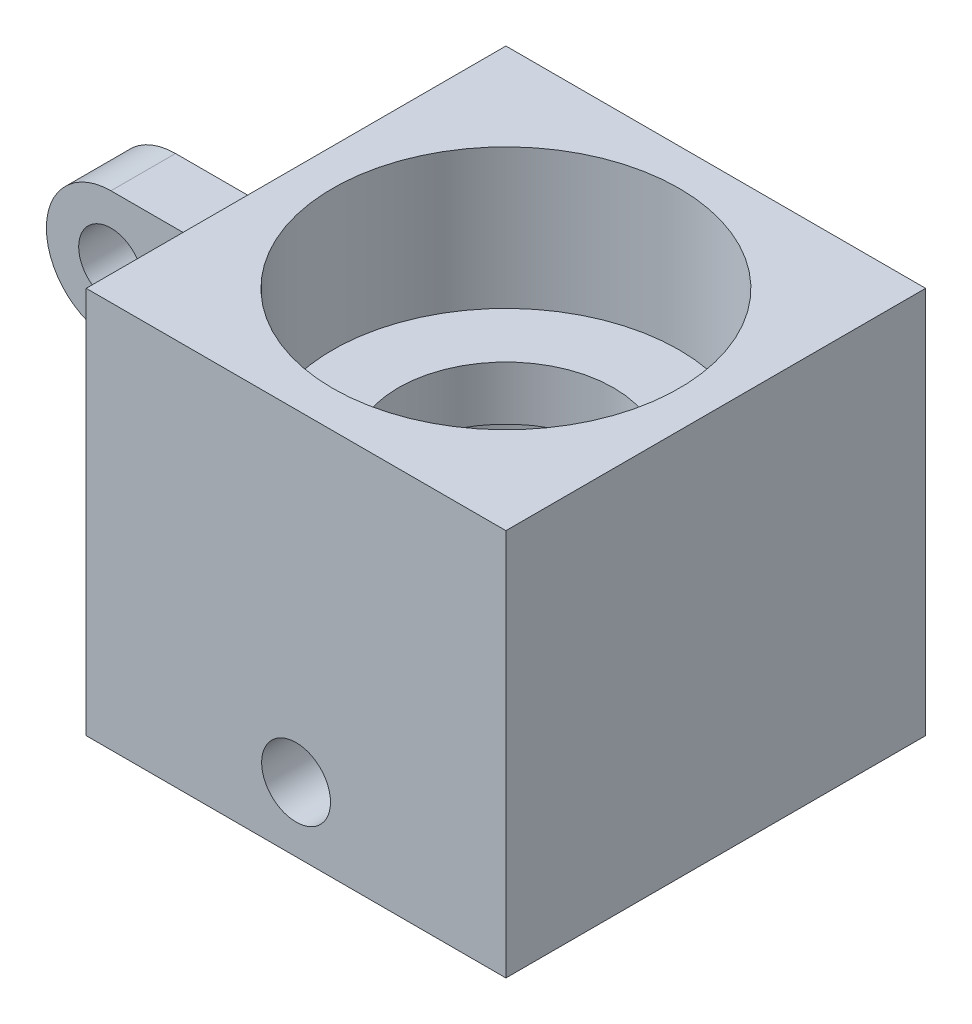
ISO-10303-21;
HEADER;
FILE_DESCRIPTION(('STEP AP214'),'2;1');
FILE_NAME('part.step','',(''),(''),'','','');
FILE_SCHEMA(('AUTOMOTIVE_DESIGN { 1 0 10303 214 1 1 1 1 }'));
ENDSEC;
DATA;
#1=APPLICATION_CONTEXT('core data for automotive mechanical design processes');
#2=APPLICATION_PROTOCOL_DEFINITION('international standard','automotive_design',2000,#1);
#3=PRODUCT_CONTEXT('',#1,'mechanical');
#4=PRODUCT('Part','Part','',(#3));
#5=PRODUCT_RELATED_PRODUCT_CATEGORY('part','',(#4));
#6=PRODUCT_DEFINITION_FORMATION('','',#4);
#7=PRODUCT_DEFINITION_CONTEXT('part definition',#1,'design');
#8=PRODUCT_DEFINITION('design','',#6,#7);
#9=PRODUCT_DEFINITION_SHAPE('','',#8);
#10=(LENGTH_UNIT() NAMED_UNIT(*) SI_UNIT(.MILLI.,.METRE.));
#11=(NAMED_UNIT(*) PLANE_ANGLE_UNIT() SI_UNIT($,.RADIAN.));
#12=(NAMED_UNIT(*) SI_UNIT($,.STERADIAN.) SOLID_ANGLE_UNIT());
#13=UNCERTAINTY_MEASURE_WITH_UNIT(LENGTH_MEASURE(1.E-05),#10,'distance_accuracy_value','');
#14=(GEOMETRIC_REPRESENTATION_CONTEXT(3) GLOBAL_UNCERTAINTY_ASSIGNED_CONTEXT((#13)) GLOBAL_UNIT_ASSIGNED_CONTEXT((#10,
#11,#12)) REPRESENTATION_CONTEXT('',''));
#15=CARTESIAN_POINT('',(0.,0.,0.));
#16=DIRECTION('',(0.,0.,1.));
#17=DIRECTION('',(1.,0.,0.));
#18=AXIS2_PLACEMENT_3D('',#15,#16,#17);
#19=CARTESIAN_POINT('',(0.,18.,0.));
#20=DIRECTION('',(0.,1.,0.));
#21=DIRECTION('',(0.,0.,1.));
#22=AXIS2_PLACEMENT_3D('',#19,#20,#21);
#23=PLANE('',#22);
#24=CARTESIAN_POINT('',(0.,18.,0.));
#25=DIRECTION('',(0.,1.,0.));
#26=DIRECTION('',(0.,0.,1.));
#27=AXIS2_PLACEMENT_3D('',#24,#25,#26);
#28=CIRCLE('',#27,8.05);
#29=CARTESIAN_POINT('',(0.,18.,8.05));
#30=VERTEX_POINT('',#29);
#31=EDGE_CURVE('E172',#30,#30,#28,.T.);
#32=ORIENTED_EDGE('',*,*,#31,.F.);
#33=EDGE_LOOP('',(#32));
#34=FACE_BOUND('',#33,.T.);
#35=DIRECTION('',(0.,0.,1.));
#36=VECTOR('',#35,1.);
#37=CARTESIAN_POINT('',(9.75,18.,-9.751));
#38=LINE('',#37,#36);
#39=CARTESIAN_POINT('',(9.75,18.,-9.75));
#40=VERTEX_POINT('',#39);
#41=CARTESIAN_POINT('',(9.75,18.,9.75));
#42=VERTEX_POINT('',#41);
#43=EDGE_CURVE('E164',#40,#42,#38,.T.);
#44=ORIENTED_EDGE('',*,*,#43,.F.);
#45=DIRECTION('',(1.,0.,0.));
#46=VECTOR('',#45,1.);
#47=CARTESIAN_POINT('',(0.,18.,-9.75));
#48=LINE('',#47,#46);
#49=CARTESIAN_POINT('',(-9.75,18.,-9.75));
#50=VERTEX_POINT('',#49);
#51=EDGE_CURVE('E136',#50,#40,#48,.T.);
#52=ORIENTED_EDGE('',*,*,#51,.F.);
#53=DIRECTION('',(0.,0.,1.));
#54=VECTOR('',#53,1.);
#55=CARTESIAN_POINT('',(-9.75,18.,-9.751));
#56=LINE('',#55,#54);
#57=CARTESIAN_POINT('',(-9.75,18.,9.75));
#58=VERTEX_POINT('',#57);
#59=EDGE_CURVE('E148',#50,#58,#56,.T.);
#60=ORIENTED_EDGE('',*,*,#59,.T.);
#61=DIRECTION('',(-1.,0.,0.));
#62=VECTOR('',#61,1.);
#63=CARTESIAN_POINT('',(-9.75,18.,9.75));
#64=LINE('',#63,#62);
#65=EDGE_CURVE('E156',#42,#58,#64,.T.);
#66=ORIENTED_EDGE('',*,*,#65,.F.);
#67=EDGE_LOOP('',(#44,#52,#60,#66));
#68=FACE_BOUND('',#67,.T.);
#69=ADVANCED_FACE('F37',(#34,#68),#23,.T.);
#70=CARTESIAN_POINT('',(0.,0.,0.));
#71=DIRECTION('',(0.,1.,0.));
#72=DIRECTION('',(0.,0.,1.));
#73=AXIS2_PLACEMENT_3D('',#70,#71,#72);
#74=PLANE('',#73);
#75=CARTESIAN_POINT('',(0.,0.,0.));
#76=DIRECTION('',(0.,1.,0.));
#77=DIRECTION('',(0.,0.,1.));
#78=AXIS2_PLACEMENT_3D('',#75,#76,#77);
#79=CIRCLE('',#78,7.5);
#80=CARTESIAN_POINT('',(0.,0.,7.5));
#81=VERTEX_POINT('',#80);
#82=EDGE_CURVE('E171',#81,#81,#79,.T.);
#83=ORIENTED_EDGE('',*,*,#82,.T.);
#84=EDGE_LOOP('',(#83));
#85=FACE_BOUND('',#84,.T.);
#86=DIRECTION('',(1.,0.,0.));
#87=VECTOR('',#86,1.);
#88=CARTESIAN_POINT('',(0.,0.,-6.75));
#89=LINE('',#88,#87);
#90=CARTESIAN_POINT('',(-25.1,0.,-6.75));
#91=VERTEX_POINT('',#90);
#92=CARTESIAN_POINT('',(-9.75,0.,-6.75));
#93=VERTEX_POINT('',#92);
#94=EDGE_CURVE('E106',#91,#93,#89,.T.);
#95=ORIENTED_EDGE('',*,*,#94,.F.);
#96=DIRECTION('',(0.,0.,-1.));
#97=VECTOR('',#96,1.);
#98=CARTESIAN_POINT('',(-25.1,0.,-9.75));
#99=LINE('',#98,#97);
#100=CARTESIAN_POINT('',(-25.1,0.,-9.75));
#101=VERTEX_POINT('',#100);
#102=EDGE_CURVE('E179',#91,#101,#99,.T.);
#103=ORIENTED_EDGE('',*,*,#102,.T.);
#104=DIRECTION('',(1.,0.,0.));
#105=VECTOR('',#104,1.);
#106=CARTESIAN_POINT('',(0.,0.,-9.75));
#107=LINE('',#106,#105);
#108=CARTESIAN_POINT('',(9.75,0.,-9.75));
#109=VERTEX_POINT('',#108);
#110=EDGE_CURVE('E142',#101,#109,#107,.T.);
#111=ORIENTED_EDGE('',*,*,#110,.T.);
#112=DIRECTION('',(0.,0.,1.));
#113=VECTOR('',#112,1.);
#114=CARTESIAN_POINT('',(9.75,0.,-9.751));
#115=LINE('',#114,#113);
#116=CARTESIAN_POINT('',(9.75,0.,9.75));
#117=VERTEX_POINT('',#116);
#118=EDGE_CURVE('E159',#109,#117,#115,.T.);
#119=ORIENTED_EDGE('',*,*,#118,.T.);
#120=DIRECTION('',(1.,0.,0.));
#121=VECTOR('',#120,1.);
#122=CARTESIAN_POINT('',(-9.75,0.,9.75));
#123=LINE('',#122,#121);
#124=CARTESIAN_POINT('',(-9.75,0.,9.75));
#125=VERTEX_POINT('',#124);
#126=EDGE_CURVE('E157',#125,#117,#123,.T.);
#127=ORIENTED_EDGE('',*,*,#126,.F.);
#128=DIRECTION('',(0.,0.,1.));
#129=VECTOR('',#128,1.);
#130=CARTESIAN_POINT('',(-9.75,0.,-9.751));
#131=LINE('',#130,#129);
#132=EDGE_CURVE('E145',#93,#125,#131,.T.);
#133=ORIENTED_EDGE('',*,*,#132,.F.);
#134=EDGE_LOOP('',(#95,#103,#111,#119,#127,#133));
#135=FACE_BOUND('',#134,.T.);
#136=ADVANCED_FACE('F221',(#85,#135),#74,.F.);
#137=CARTESIAN_POINT('',(0.,9.,0.));
#138=DIRECTION('',(0.,-1.,0.));
#139=DIRECTION('',(0.,0.,-1.));
#140=AXIS2_PLACEMENT_3D('',#137,#138,#139);
#141=CYLINDRICAL_SURFACE('',#140,7.5);
#142=CARTESIAN_POINT('',(0.,4.6,-7.5));
#143=CARTESIAN_POINT('',(-0.0887944293338555,4.59999689419536,-7.4999983570598));
#144=CARTESIAN_POINT('',(-0.177626889700681,4.59258336552044,-7.49840703800838));
#145=CARTESIAN_POINT('',(-0.352772204992273,4.56315376142797,-7.49221258982039));
#146=CARTESIAN_POINT('',(-0.439083150622767,4.54112690542328,-7.48760723719598));
#147=CARTESIAN_POINT('',(-0.606628580180659,4.48318904804614,-7.47589793294748));
#148=CARTESIAN_POINT('',(-0.687868139445261,4.44729219487858,-7.46879652810656));
#149=CARTESIAN_POINT('',(-0.843167757727071,4.36267739239734,-7.45286320133509));
#150=CARTESIAN_POINT('',(-0.917228073407919,4.31395990166309,-7.4440313413038));
#151=CARTESIAN_POINT('',(-1.05720419368928,4.20429716953458,-7.42545480782523));
#152=CARTESIAN_POINT('',(-1.12299434543086,4.14319336689695,-7.41569927510424));
#153=CARTESIAN_POINT('',(-1.24347351522622,4.010833063914,-7.39645215099328));
#154=CARTESIAN_POINT('',(-1.29816158128342,3.9395756937978,-7.38696058229821));
#155=CARTESIAN_POINT('',(-1.39543277767187,3.78800940494011,-7.36920930951561));
#156=CARTESIAN_POINT('',(-1.43788322502763,3.70761355668354,-7.36096353805546));
#157=CARTESIAN_POINT('',(-1.50862340101052,3.54062468310145,-7.34679287525929));
#158=CARTESIAN_POINT('',(-1.53691473453874,3.45403236140341,-7.34086772090353));
#159=CARTESIAN_POINT('',(-1.5781204953587,3.27846838088968,-7.33211955105285));
#160=CARTESIAN_POINT('',(-1.59125680705956,3.18955107459205,-7.32925182047022));
#161=CARTESIAN_POINT('',(-1.60246934089929,3.01073195584931,-7.32680881403605));
#162=CARTESIAN_POINT('',(-1.60054732105774,2.92083025955284,-7.32723315384412));
#163=CARTESIAN_POINT('',(-1.58187655808685,2.74423604448313,-7.33128581769295));
#164=CARTESIAN_POINT('',(-1.56538455643806,2.6575149158877,-7.33485865843677));
#165=CARTESIAN_POINT('',(-1.51844828834832,2.48809934830167,-7.34471814062502));
#166=CARTESIAN_POINT('',(-1.48800327344863,2.4054051255831,-7.35100492764819));
#167=CARTESIAN_POINT('',(-1.41378668233803,2.24566362655982,-7.36563922179753));
#168=CARTESIAN_POINT('',(-1.36991548636568,2.1686640952086,-7.37400204199821));
#169=CARTESIAN_POINT('',(-1.27016199217251,2.02302428677123,-7.39183660364213));
#170=CARTESIAN_POINT('',(-1.21427813244002,1.95438509825491,-7.40130848917848));
#171=CARTESIAN_POINT('',(-1.09072196751541,1.82593524608154,-7.4205326849195));
#172=CARTESIAN_POINT('',(-1.02283110172082,1.76633488213618,-7.43028675890513));
#173=CARTESIAN_POINT('',(-0.877908758701802,1.65933258631255,-7.44879883076769));
#174=CARTESIAN_POINT('',(-0.800877131200498,1.61193085502408,-7.45755681226393));
#175=CARTESIAN_POINT('',(-0.639610081827262,1.53062332499256,-7.4731161994162));
#176=CARTESIAN_POINT('',(-0.555360898326548,1.49674403771802,-7.47991375438739));
#177=CARTESIAN_POINT('',(-0.382188547319413,1.44368065879573,-7.49075760800742));
#178=CARTESIAN_POINT('',(-0.293266027489785,1.42449453653411,-7.49480428682212));
#179=CARTESIAN_POINT('',(-0.115076046551737,1.40166556981614,-7.49963667143352));
#180=CARTESIAN_POINT('',(-0.0258469966592099,1.39773530031401,-7.50048267119555));
#181=CARTESIAN_POINT('',(0.151992686528,1.4047520312125,-7.49898689492793));
#182=CARTESIAN_POINT('',(0.240603359252846,1.41569807416564,-7.49664532405204));
#183=CARTESIAN_POINT('',(0.413746062380253,1.45191822521633,-7.48907546339841));
#184=CARTESIAN_POINT('',(0.498310863335301,1.47704254852517,-7.48387736587364));
#185=CARTESIAN_POINT('',(0.662026395792984,1.54074058388016,-7.47117587533623));
#186=CARTESIAN_POINT('',(0.741176681186478,1.5793154025379,-7.46367229265062));
#187=CARTESIAN_POINT('',(0.893011950773005,1.66942507461825,-7.44704294085318));
#188=CARTESIAN_POINT('',(0.965593659738482,1.72113002651483,-7.43789638159133));
#189=CARTESIAN_POINT('',(1.10115356003048,1.83580715603025,-7.41903990869546));
#190=CARTESIAN_POINT('',(1.16413056725132,1.8987807208118,-7.40932992580373));
#191=CARTESIAN_POINT('',(1.27982177561402,2.03552343962769,-7.39023419815026));
#192=CARTESIAN_POINT('',(1.33233743532724,2.10946199340809,-7.38085708289827));
#193=CARTESIAN_POINT('',(1.42420609305472,2.26527871151165,-7.36368318738415));
#194=CARTESIAN_POINT('',(1.46355965021717,2.34715653837054,-7.35588633999514));
#195=CARTESIAN_POINT('',(1.52772807228231,2.5160945750566,-7.3428278116798));
#196=CARTESIAN_POINT('',(1.55262307368944,2.6031232157705,-7.33755218632522));
#197=CARTESIAN_POINT('',(1.58740514879098,2.78025472587967,-7.33010689029808));
#198=CARTESIAN_POINT('',(1.59729448874882,2.87035712895102,-7.32793675061545));
#199=CARTESIAN_POINT('',(1.60169174862619,3.04907925727694,-7.32697666157729));
#200=CARTESIAN_POINT('',(1.59651412882043,3.13769102055621,-7.32811760571581));
#201=CARTESIAN_POINT('',(1.57162478005708,3.31274860255213,-7.33349539816058));
#202=CARTESIAN_POINT('',(1.55191320540032,3.39919444425336,-7.33773221359929));
#203=CARTESIAN_POINT('',(1.49866402761735,3.5672312446234,-7.34879149338566));
#204=CARTESIAN_POINT('',(1.46517005919756,3.64883660353434,-7.35560579203591));
#205=CARTESIAN_POINT('',(1.38534516691845,3.80531708369125,-7.37105584436333));
#206=CARTESIAN_POINT('',(1.33901298148492,3.8801915425531,-7.37969177702726));
#207=CARTESIAN_POINT('',(1.23377464987916,4.02263967744949,-7.39801997202294));
#208=CARTESIAN_POINT('',(1.17464349733653,4.09004494825338,-7.40772937703983));
#209=CARTESIAN_POINT('',(1.0459443480745,4.21407953214307,-7.42699305436863));
#210=CARTESIAN_POINT('',(0.976373947694455,4.27070635663727,-7.43654729038956));
#211=CARTESIAN_POINT('',(0.827748193968453,4.37223603945681,-7.4545622712928));
#212=CARTESIAN_POINT('',(0.748587403501146,4.41698730989109,-7.46300824065792));
#213=CARTESIAN_POINT('',(0.583706040029168,4.49247899855657,-7.47770774713458));
#214=CARTESIAN_POINT('',(0.497991165498194,4.52323142992907,-7.48396316300769));
#215=CARTESIAN_POINT('',(0.34346476310391,4.56422976291382,-7.49243099511991));
#216=CARTESIAN_POINT('',(0.275502835649663,4.57761851465133,-7.4952520823403));
#217=CARTESIAN_POINT('',(0.138368271279889,4.59550466399851,-7.49903718747764));
#218=CARTESIAN_POINT('',(0.0691956833185955,4.60000242029006,-7.5000012803097));
#219=CARTESIAN_POINT('',(0.,4.6,-7.5));
#220=B_SPLINE_CURVE_WITH_KNOTS('',3,(#142,#143,#144,#145,#146,#147,#148,#149,#150,#151,#152,
#153,#154,#155,#156,#157,#158,#159,#160,#161,#162,#163,#164,#165,#166,#167,#168,#169,#170,#171,
#172,#173,#174,#175,#176,#177,#178,#179,#180,#181,#182,#183,#184,#185,#186,#187,#188,#189,#190,
#191,#192,#193,#194,#195,#196,#197,#198,#199,#200,#201,#202,#203,#204,#205,#206,#207,#208,#209,
#210,#211,#212,#213,#214,#215,#216,#217,#218,#219),.UNSPECIFIED.,.T.,.F.,(4,2,2,2,2,2,2,2,2,2,2,
2,2,2,2,2,2,2,2,2,2,2,2,2,2,2,2,2,2,2,2,2,2,2,2,2,2,2,4),(0.,0.266130047854763,
0.532456644597193,0.798512286868045,1.0645584139285,1.33425388789939,1.60397247832158,
1.87651399120587,2.14902460517277,2.41749263134366,2.68592931506412,2.94972810159234,
3.21354104030559,3.47936093436643,3.74521540295248,4.01653060252532,4.28785026321979,
4.55969927797482,4.83151071607125,5.09817555204362,5.36482322613615,5.62870529395039,
5.89260907723844,6.16012360036749,6.42767107713311,6.69989324302713,6.97210384299803,
7.24279095265699,7.51343717712195,7.77847555890145,8.04351112692155,8.30771397733335,
8.57194279940304,8.84126112654219,9.11064156026671,9.38331104903345,9.65574610257701,
9.86314417471903,10.0705338798061),.UNSPECIFIED.);
#221=CARTESIAN_POINT('',(0.,4.6,-7.5));
#222=VERTEX_POINT('',#221);
#223=EDGE_CURVE('E175',#222,#222,#220,.T.);
#224=ORIENTED_EDGE('',*,*,#223,.F.);
#225=EDGE_LOOP('',(#224));
#226=FACE_BOUND('',#225,.T.);
#227=CARTESIAN_POINT('',(-1.6,3.,7.32734604068895));
#228=CARTESIAN_POINT('',(-1.59999687521768,3.0887685100711,7.32734783204889));
#229=CARTESIAN_POINT('',(-1.59258752711157,3.1775750992943,7.32897670533243));
#230=CARTESIAN_POINT('',(-1.56317603196586,3.35266670741716,7.33530494590012));
#231=CARTESIAN_POINT('',(-1.54116300148996,3.43894979556067,7.3400066031465));
#232=CARTESIAN_POINT('',(-1.48326555897742,3.6064362066757,7.35192423987447));
#233=CARTESIAN_POINT('',(-1.44739594342864,3.68764484120461,7.3591375365424));
#234=CARTESIAN_POINT('',(-1.36284536038589,3.84289225870409,7.37526247893005));
#235=CARTESIAN_POINT('',(-1.31416478963062,3.91693126361169,7.38417407205336));
#236=CARTESIAN_POINT('',(-1.20454002688148,4.05692983916243,7.40285153964238));
#237=CARTESIAN_POINT('',(-1.14342897607145,4.12275737738522,7.4126278874916));
#238=CARTESIAN_POINT('',(-1.01103827358584,4.24330916231062,7.43184148234544));
#239=CARTESIAN_POINT('',(-0.939757855827599,4.29803257175975,7.44127870373573));
#240=CARTESIAN_POINT('',(-0.788169783859917,4.39534204711686,7.45886446546389));
#241=CARTESIAN_POINT('',(-0.70777915930554,4.4378015699902,7.46699920907061));
#242=CARTESIAN_POINT('',(-0.540801563567203,4.50855994533145,7.48094533800134));
#243=CARTESIAN_POINT('',(-0.454215254422202,4.53686030819922,7.48675697112518));
#244=CARTESIAN_POINT('',(-0.278676257286043,4.57808300960865,7.4953280596337));
#245=CARTESIAN_POINT('',(-0.189778209864772,4.59122866317342,7.49813179441585));
#246=CARTESIAN_POINT('',(-0.010997287248263,4.60246656338555,7.5005244520832));
#247=CARTESIAN_POINT('',(0.0788854794810493,4.60056045164981,7.50011372555284));
#248=CARTESIAN_POINT('',(0.255546402374116,4.58191615631798,7.49615771852237));
#249=CARTESIAN_POINT('',(0.342351262803163,4.56541862972292,7.49266329963279));
#250=CARTESIAN_POINT('',(0.511931382190347,4.51844277484243,7.48299031427627));
#251=CARTESIAN_POINT('',(0.594706464721116,4.4879638350457,7.47681163040705));
#252=CARTESIAN_POINT('',(0.754550882880951,4.41367449572029,7.46238195623954));
#253=CARTESIAN_POINT('',(0.831576062489074,4.36977196910886,7.45411671633686));
#254=CARTESIAN_POINT('',(0.97725415116399,4.2699502243687,7.43642166419509));
#255=CARTESIAN_POINT('',(1.04590596996944,4.21402944400459,7.42699170062309));
#256=CARTESIAN_POINT('',(1.1743189871499,4.09044536673716,7.40778511114788));
#257=CARTESIAN_POINT('',(1.23387717194844,4.02257143781813,7.39800531840364));
#258=CARTESIAN_POINT('',(1.34080220178098,3.87769857523078,7.37937693038443));
#259=CARTESIAN_POINT('',(1.38816874804634,3.8006994180069,7.37052835793311));
#260=CARTESIAN_POINT('',(1.46945010087399,3.63944452104654,7.35475651444397));
#261=CARTESIAN_POINT('',(1.50332818047939,3.55516971894304,7.34783851514439));
#262=CARTESIAN_POINT('',(1.55638146230778,3.38194121509158,7.33678531116542));
#263=CARTESIAN_POINT('',(1.57555887179257,3.29298821790476,7.33264968873186));
#264=CARTESIAN_POINT('',(1.59835496135295,3.11477894000118,7.32771425542105));
#265=CARTESIAN_POINT('',(1.60226852153074,3.02556208684323,7.32685123090565));
#266=CARTESIAN_POINT('',(1.59522273599979,2.8477506677869,7.32838843572104));
#267=CARTESIAN_POINT('',(1.58426435850705,2.75915606175548,7.33078845261626));
#268=CARTESIAN_POINT('',(1.54804113817799,2.58612016761893,7.33852177157955));
#269=CARTESIAN_POINT('',(1.52293726454489,2.50164357089464,7.34382205072082));
#270=CARTESIAN_POINT('',(1.45930930111439,2.338095500714,7.35672914405465));
#271=CARTESIAN_POINT('',(1.42078397878081,2.25902452447175,7.36433617007512));
#272=CARTESIAN_POINT('',(1.3307517679701,2.10725190691673,7.38113944964658));
#273=CARTESIAN_POINT('',(1.27906237846837,2.03466097902885,7.39035742068726));
#274=CARTESIAN_POINT('',(1.16440942349652,1.89907535110419,7.40928600589101));
#275=CARTESIAN_POINT('',(1.10144452944021,1.83608178353945,7.41899667801202));
#276=CARTESIAN_POINT('',(0.964696649513289,1.72034234685536,7.43802394390857));
#277=CARTESIAN_POINT('',(0.890742299881099,1.66779703072942,7.44733055372857));
#278=CARTESIAN_POINT('',(0.734884872162142,1.57587637439103,7.46432047157701));
#279=CARTESIAN_POINT('',(0.65298215538974,1.53650043589063,7.47200385334324));
#280=CARTESIAN_POINT('',(0.484049906499258,1.47231945842674,7.48483934479639));
#281=CARTESIAN_POINT('',(0.397055665841016,1.44742477608375,7.49000699441327));
#282=CARTESIAN_POINT('',(0.219997709997885,1.41263173205883,7.49729580275604));
#283=CARTESIAN_POINT('',(0.129934419922701,1.40273130201046,7.49941738166686));
#284=CARTESIAN_POINT('',(-0.0487977681305968,1.39829699175498,7.50036328067436));
#285=CARTESIAN_POINT('',(-0.137459015607027,1.40346307298598,7.49925198227476));
#286=CARTESIAN_POINT('',(-0.312618673313176,1.42834658015261,7.49399416638132));
#287=CARTESIAN_POINT('',(-0.399117118774428,1.44806376889428,7.48984769836304));
#288=CARTESIAN_POINT('',(-0.567277052878257,1.50134901504737,7.47898934152454));
#289=CARTESIAN_POINT('',(-0.648951936497362,1.53487643213246,7.47228498421878));
#290=CARTESIAN_POINT('',(-0.80555784629483,1.61479002736396,7.4570285062036));
#291=CARTESIAN_POINT('',(-0.880488251937904,1.66117738710899,7.44847621571812));
#292=CARTESIAN_POINT('',(-1.02294779578885,1.76648248217597,7.43026476347602));
#293=CARTESIAN_POINT('',(-1.09031795731115,1.82561231982064,7.42058833247677));
#294=CARTESIAN_POINT('',(-1.21428232218523,1.95429363888894,7.40131497163695));
#295=CARTESIAN_POINT('',(-1.27087393971624,2.02384761397618,7.39171806140062));
#296=CARTESIAN_POINT('',(-1.37235806742357,2.17245456146852,7.37355623892386));
#297=CARTESIAN_POINT('',(-1.41709443670196,2.25161602988675,7.36500582897484));
#298=CARTESIAN_POINT('',(-1.49255808840325,2.41649726202727,7.3500858193436));
#299=CARTESIAN_POINT('',(-1.5232974824127,2.50221128052181,7.34371433542935));
#300=CARTESIAN_POINT('',(-1.56426527791603,2.6567046315602,7.33507966715627));
#301=CARTESIAN_POINT('',(-1.57764062026348,2.72463247703799,7.3321984207885));
#302=CARTESIAN_POINT('',(-1.59550900254637,2.86169921223266,7.32833095153541));
#303=CARTESIAN_POINT('',(-1.60000243460258,2.93083804835046,7.32734464499187));
#304=CARTESIAN_POINT('',(-1.6,3.,7.32734604068895));
#305=B_SPLINE_CURVE_WITH_KNOTS('',3,(#227,#228,#229,#230,#231,#232,#233,#234,#235,#236,#237,
#238,#239,#240,#241,#242,#243,#244,#245,#246,#247,#248,#249,#250,#251,#252,#253,#254,#255,#256,
#257,#258,#259,#260,#261,#262,#263,#264,#265,#266,#267,#268,#269,#270,#271,#272,#273,#274,#275,
#276,#277,#278,#279,#280,#281,#282,#283,#284,#285,#286,#287,#288,#289,#290,#291,#292,#293,#294,
#295,#296,#297,#298,#299,#300,#301,#302,#303,#304),.UNSPECIFIED.,.T.,.F.,(4,2,2,2,2,2,2,2,2,2,2,
2,2,2,2,2,2,2,2,2,2,2,2,2,2,2,2,2,2,2,2,2,2,2,2,2,2,2,4),(0.,0.266052129745754,
0.532302758678047,0.798269859408134,1.06422872445041,1.33402614177927,1.60384389433342,
1.87635365044247,2.14883433092115,2.41724632343608,2.68562904207089,2.94966617354387,
3.21371485442776,3.47961802162733,3.74555577412269,4.01676058380499,4.28797203900696,
4.55991699098621,4.83182110323962,5.09844553370915,5.36505260681318,5.62868536677038,
5.89234234338366,6.15987500944547,6.42743921949375,6.69972716505267,6.9720027388247,
7.24257439749418,7.51310872903873,7.7782925828225,8.043472114006,8.30787679551559,
8.57230577914047,8.84153310165344,9.11082493186949,9.38350466142434,9.65594799064849,
9.86324556645522,10.0705339902329),.UNSPECIFIED.);
#306=CARTESIAN_POINT('',(-1.6,3.,7.32734604068895));
#307=VERTEX_POINT('',#306);
#308=EDGE_CURVE('E166',#307,#307,#305,.T.);
#309=ORIENTED_EDGE('',*,*,#308,.F.);
#310=EDGE_LOOP('',(#309));
#311=FACE_BOUND('',#310,.T.);
#312=CARTESIAN_POINT('',(0.,9.,0.));
#313=DIRECTION('',(0.,1.,0.));
#314=DIRECTION('',(0.,0.,1.));
#315=AXIS2_PLACEMENT_3D('',#312,#313,#314);
#316=CIRCLE('',#315,7.5);
#317=CARTESIAN_POINT('',(0.,9.,7.5));
#318=VERTEX_POINT('',#317);
#319=EDGE_CURVE('E176',#318,#318,#316,.T.);
#320=ORIENTED_EDGE('',*,*,#319,.T.);
#321=EDGE_LOOP('',(#320));
#322=FACE_BOUND('',#321,.T.);
#323=ORIENTED_EDGE('',*,*,#82,.F.);
#324=EDGE_LOOP('',(#323));
#325=FACE_BOUND('',#324,.T.);
#326=ADVANCED_FACE('F193',(#226,#311,#322,#325),#141,.F.);
#327=CARTESIAN_POINT('',(0.,9.,0.));
#328=DIRECTION('',(0.,1.,0.));
#329=DIRECTION('',(0.,0.,1.));
#330=AXIS2_PLACEMENT_3D('',#327,#328,#329);
#331=PLANE('',#330);
#332=CARTESIAN_POINT('',(0.,9.,0.));
#333=DIRECTION('',(0.,1.,0.));
#334=DIRECTION('',(0.,0.,1.));
#335=AXIS2_PLACEMENT_3D('',#332,#333,#334);
#336=CIRCLE('',#335,5.);
#337=CARTESIAN_POINT('',(0.,9.,5.));
#338=VERTEX_POINT('',#337);
#339=EDGE_CURVE('E253',#338,#338,#336,.T.);
#340=ORIENTED_EDGE('',*,*,#339,.T.);
#341=EDGE_LOOP('',(#340));
#342=FACE_BOUND('',#341,.T.);
#343=ORIENTED_EDGE('',*,*,#319,.F.);
#344=EDGE_LOOP('',(#343));
#345=FACE_BOUND('',#344,.T.);
#346=ADVANCED_FACE('F214',(#342,#345),#331,.F.);
#347=CARTESIAN_POINT('',(0.,11.5,0.));
#348=DIRECTION('',(0.,1.,0.));
#349=DIRECTION('',(0.,0.,1.));
#350=AXIS2_PLACEMENT_3D('',#347,#348,#349);
#351=CYLINDRICAL_SURFACE('',#350,8.05);
#352=CARTESIAN_POINT('',(0.,11.5,0.));
#353=DIRECTION('',(0.,1.,0.));
#354=DIRECTION('',(0.,0.,1.));
#355=AXIS2_PLACEMENT_3D('',#352,#353,#354);
#356=CIRCLE('',#355,8.05);
#357=CARTESIAN_POINT('',(0.,11.5,8.05));
#358=VERTEX_POINT('',#357);
#359=EDGE_CURVE('E168',#358,#358,#356,.T.);
#360=CARTESIAN_POINT('',(0.,11.5,8.05));
#361=CARTESIAN_POINT('',(0.,11.5677083333333,8.05));
#362=CARTESIAN_POINT('',(0.,11.6354166666667,8.05));
#363=CARTESIAN_POINT('',(0.,11.7708333333333,8.05));
#364=CARTESIAN_POINT('',(0.,11.8385416666667,8.05));
#365=CARTESIAN_POINT('',(0.,11.9739583333333,8.05));
#366=CARTESIAN_POINT('',(0.,12.0416666666667,8.05));
#367=CARTESIAN_POINT('',(0.,12.1770833333333,8.05));
#368=CARTESIAN_POINT('',(0.,12.2447916666667,8.05));
#369=CARTESIAN_POINT('',(0.,12.3802083333333,8.05));
#370=CARTESIAN_POINT('',(0.,12.4479166666667,8.05));
#371=CARTESIAN_POINT('',(0.,12.5833333333333,8.05));
#372=CARTESIAN_POINT('',(0.,12.6510416666667,8.05));
#373=CARTESIAN_POINT('',(0.,12.7864583333333,8.05));
#374=CARTESIAN_POINT('',(0.,12.8541666666667,8.05));
#375=CARTESIAN_POINT('',(0.,12.9895833333333,8.05));
#376=CARTESIAN_POINT('',(0.,13.0572916666667,8.05));
#377=CARTESIAN_POINT('',(0.,13.1927083333333,8.05));
#378=CARTESIAN_POINT('',(0.,13.2604166666667,8.05));
#379=CARTESIAN_POINT('',(0.,13.3958333333333,8.05));
#380=CARTESIAN_POINT('',(0.,13.4635416666667,8.05));
#381=CARTESIAN_POINT('',(0.,13.5989583333333,8.05));
#382=CARTESIAN_POINT('',(0.,13.6666666666667,8.05));
#383=CARTESIAN_POINT('',(0.,13.8020833333333,8.05));
#384=CARTESIAN_POINT('',(0.,13.8697916666667,8.05));
#385=CARTESIAN_POINT('',(0.,14.0052083333333,8.05));
#386=CARTESIAN_POINT('',(0.,14.0729166666667,8.05));
#387=CARTESIAN_POINT('',(0.,14.2083333333333,8.05));
#388=CARTESIAN_POINT('',(0.,14.2760416666667,8.05));
#389=CARTESIAN_POINT('',(0.,14.4114583333333,8.05));
#390=CARTESIAN_POINT('',(0.,14.4791666666667,8.05));
#391=CARTESIAN_POINT('',(0.,14.6145833333333,8.05));
#392=CARTESIAN_POINT('',(0.,14.6822916666667,8.05));
#393=CARTESIAN_POINT('',(0.,14.8177083333333,8.05));
#394=CARTESIAN_POINT('',(0.,14.8854166666667,8.05));
#395=CARTESIAN_POINT('',(0.,15.0208333333333,8.05));
#396=CARTESIAN_POINT('',(0.,15.0885416666667,8.05));
#397=CARTESIAN_POINT('',(0.,15.2239583333333,8.05));
#398=CARTESIAN_POINT('',(0.,15.2916666666667,8.05));
#399=CARTESIAN_POINT('',(0.,15.4270833333333,8.05));
#400=CARTESIAN_POINT('',(0.,15.4947916666667,8.05));
#401=CARTESIAN_POINT('',(0.,15.6302083333333,8.05));
#402=CARTESIAN_POINT('',(0.,15.6979166666667,8.05));
#403=CARTESIAN_POINT('',(0.,15.8333333333333,8.05));
#404=CARTESIAN_POINT('',(0.,15.9010416666667,8.05));
#405=CARTESIAN_POINT('',(0.,16.0364583333333,8.05));
#406=CARTESIAN_POINT('',(0.,16.1041666666667,8.05));
#407=CARTESIAN_POINT('',(0.,16.2395833333333,8.05));
#408=CARTESIAN_POINT('',(0.,16.3072916666667,8.05));
#409=CARTESIAN_POINT('',(0.,16.4427083333333,8.05));
#410=CARTESIAN_POINT('',(0.,16.5104166666667,8.05));
#411=CARTESIAN_POINT('',(0.,16.6458333333333,8.05));
#412=CARTESIAN_POINT('',(0.,16.7135416666667,8.05));
#413=CARTESIAN_POINT('',(0.,16.8489583333333,8.05));
#414=CARTESIAN_POINT('',(0.,16.9166666666667,8.05));
#415=CARTESIAN_POINT('',(0.,17.0520833333333,8.05));
#416=CARTESIAN_POINT('',(0.,17.1197916666667,8.05));
#417=CARTESIAN_POINT('',(0.,17.2552083333333,8.05));
#418=CARTESIAN_POINT('',(0.,17.3229166666667,8.05));
#419=CARTESIAN_POINT('',(0.,17.4583333333333,8.05));
#420=CARTESIAN_POINT('',(0.,17.5260416666667,8.05));
#421=CARTESIAN_POINT('',(0.,17.6614583333333,8.05));
#422=CARTESIAN_POINT('',(0.,17.7291666666667,8.05));
#423=CARTESIAN_POINT('',(0.,17.8645833333333,8.05));
#424=CARTESIAN_POINT('',(0.,17.9322916666667,8.05));
#425=CARTESIAN_POINT('',(0.,18.,8.05));
#426=B_SPLINE_CURVE_WITH_KNOTS('',3,(#360,#361,#362,#363,#364,#365,#366,#367,#368,#369,#370,
#371,#372,#373,#374,#375,#376,#377,#378,#379,#380,#381,#382,#383,#384,#385,#386,#387,#388,#389,
#390,#391,#392,#393,#394,#395,#396,#397,#398,#399,#400,#401,#402,#403,#404,#405,#406,#407,#408,
#409,#410,#411,#412,#413,#414,#415,#416,#417,#418,#419,#420,#421,#422,#423,#424,#425),
.UNSPECIFIED.,.F.,.F.,(4,2,2,2,2,2,2,2,2,2,2,2,2,2,2,2,2,2,2,2,2,2,2,2,2,2,2,2,2,2,2,2,4),(0.,
0.203125,0.40625,0.609375000000001,0.812500000000001,1.015625,1.21875,1.421875,1.625,1.828125,
2.03125,2.234375,2.4375,2.640625,2.84375,3.046875,3.25,3.453125,3.65625,3.859375,4.0625,
4.265625,4.46875,4.671875,4.875,5.078125,5.28125,5.484375,5.6875,5.890625,6.09375,6.296875,6.5),.UNSPECIFIED.);
#427=EDGE_CURVE('BSEAM211',#358,#30,#426,.T.);
#428=ORIENTED_EDGE('',*,*,#359,.F.);
#429=ORIENTED_EDGE('',*,*,#31,.T.);
#430=ORIENTED_EDGE('',*,*,#427,.T.);
#431=ORIENTED_EDGE('',*,*,#427,.F.);
#432=EDGE_LOOP('',(#428,#430,#429,#431));
#433=FACE_BOUND('',#432,.T.);
#434=ADVANCED_FACE('F211',(#433),#351,.F.);
#435=CARTESIAN_POINT('',(0.,11.5,0.));
#436=DIRECTION('',(0.,1.,0.));
#437=DIRECTION('',(0.,0.,1.));
#438=AXIS2_PLACEMENT_3D('',#435,#436,#437);
#439=PLANE('',#438);
#440=CARTESIAN_POINT('',(0.,11.5,0.));
#441=DIRECTION('',(0.,1.,0.));
#442=DIRECTION('',(0.,0.,1.));
#443=AXIS2_PLACEMENT_3D('',#440,#441,#442);
#444=CIRCLE('',#443,5.);
#445=CARTESIAN_POINT('',(0.,11.5,5.));
#446=VERTEX_POINT('',#445);
#447=EDGE_CURVE('E41',#446,#446,#444,.T.);
#448=ORIENTED_EDGE('',*,*,#447,.F.);
#449=EDGE_LOOP('',(#448));
#450=FACE_BOUND('',#449,.T.);
#451=ORIENTED_EDGE('',*,*,#359,.T.);
#452=EDGE_LOOP('',(#451));
#453=FACE_BOUND('',#452,.T.);
#454=ADVANCED_FACE('F207',(#450,#453),#439,.T.);
#455=CARTESIAN_POINT('',(0.,3.,9.75));
#456=DIRECTION('',(0.,0.,-1.));
#457=DIRECTION('',(-1.,0.,0.));
#458=AXIS2_PLACEMENT_3D('',#455,#456,#457);
#459=CYLINDRICAL_SURFACE('',#458,1.6);
#460=ORIENTED_EDGE('',*,*,#308,.T.);
#461=EDGE_LOOP('',(#460));
#462=FACE_BOUND('',#461,.T.);
#463=CARTESIAN_POINT('',(0.,3.,9.75));
#464=DIRECTION('',(0.,0.,1.));
#465=DIRECTION('',(1.,0.,0.));
#466=AXIS2_PLACEMENT_3D('',#463,#464,#465);
#467=CIRCLE('',#466,1.6);
#468=CARTESIAN_POINT('',(1.6,3.,9.75));
#469=VERTEX_POINT('',#468);
#470=EDGE_CURVE('E147',#469,#469,#467,.T.);
#471=ORIENTED_EDGE('',*,*,#470,.T.);
#472=EDGE_LOOP('',(#471));
#473=FACE_BOUND('',#472,.T.);
#474=ADVANCED_FACE('F203',(#462,#473),#459,.F.);
#475=ORIENTED_EDGE('',*,*,#223,.T.);
#476=EDGE_LOOP('',(#475));
#477=FACE_BOUND('',#476,.T.);
#478=CARTESIAN_POINT('',(0.,3.,-9.75));
#479=DIRECTION('',(0.,0.,-1.));
#480=DIRECTION('',(-1.,0.,0.));
#481=AXIS2_PLACEMENT_3D('',#478,#479,#480);
#482=CIRCLE('',#481,1.6);
#483=CARTESIAN_POINT('',(-1.6,3.,-9.75));
#484=VERTEX_POINT('',#483);
#485=EDGE_CURVE('E133',#484,#484,#482,.T.);
#486=ORIENTED_EDGE('',*,*,#485,.T.);
#487=EDGE_LOOP('',(#486));
#488=FACE_BOUND('',#487,.T.);
#489=ADVANCED_FACE('F197',(#477,#488),#459,.F.);
#490=CARTESIAN_POINT('',(0.,0.,9.75));
#491=DIRECTION('',(0.,0.,-1.));
#492=DIRECTION('',(-1.,0.,0.));
#493=AXIS2_PLACEMENT_3D('',#490,#491,#492);
#494=PLANE('',#493);
#495=ORIENTED_EDGE('',*,*,#470,.F.);
#496=EDGE_LOOP('',(#495));
#497=FACE_BOUND('',#496,.T.);
#498=DIRECTION('',(0.,-1.,0.));
#499=VECTOR('',#498,1.);
#500=CARTESIAN_POINT('',(-9.75,0.,9.75));
#501=LINE('',#500,#499);
#502=EDGE_CURVE('E144',#58,#125,#501,.T.);
#503=ORIENTED_EDGE('',*,*,#502,.T.);
#504=ORIENTED_EDGE('',*,*,#126,.T.);
#505=DIRECTION('',(0.,1.,0.));
#506=VECTOR('',#505,1.);
#507=CARTESIAN_POINT('',(9.75,18.,9.75));
#508=LINE('',#507,#506);
#509=EDGE_CURVE('E153',#117,#42,#508,.T.);
#510=ORIENTED_EDGE('',*,*,#509,.T.);
#511=ORIENTED_EDGE('',*,*,#65,.T.);
#512=EDGE_LOOP('',(#503,#504,#510,#511));
#513=FACE_BOUND('',#512,.T.);
#514=ADVANCED_FACE('F202',(#497,#513),#494,.F.);
#515=CARTESIAN_POINT('',(9.75,18.,-9.751));
#516=DIRECTION('',(1.,0.,0.));
#517=DIRECTION('',(0.,0.,-1.));
#518=AXIS2_PLACEMENT_3D('',#515,#516,#517);
#519=PLANE('',#518);
#520=ORIENTED_EDGE('',*,*,#118,.F.);
#521=DIRECTION('',(0.,-1.,0.));
#522=VECTOR('',#521,1.);
#523=CARTESIAN_POINT('',(9.75,0.,-9.75));
#524=LINE('',#523,#522);
#525=EDGE_CURVE('E139',#40,#109,#524,.T.);
#526=ORIENTED_EDGE('',*,*,#525,.F.);
#527=ORIENTED_EDGE('',*,*,#43,.T.);
#528=ORIENTED_EDGE('',*,*,#509,.F.);
#529=EDGE_LOOP('',(#520,#526,#527,#528));
#530=FACE_BOUND('',#529,.T.);
#531=ADVANCED_FACE('F205',(#530),#519,.T.);
#532=CARTESIAN_POINT('',(-9.75,0.,-9.751));
#533=DIRECTION('',(-1.,0.,0.));
#534=DIRECTION('',(0.,0.,1.));
#535=AXIS2_PLACEMENT_3D('',#532,#533,#534);
#536=PLANE('',#535);
#537=DIRECTION('',(0.,0.,-1.));
#538=VECTOR('',#537,1.);
#539=CARTESIAN_POINT('',(-9.75,6.,-6.75));
#540=LINE('',#539,#538);
#541=CARTESIAN_POINT('',(-9.75,6.,-6.75));
#542=VERTEX_POINT('',#541);
#543=CARTESIAN_POINT('',(-9.75,6.,-9.75));
#544=VERTEX_POINT('',#543);
#545=EDGE_CURVE('E104',#542,#544,#540,.T.);
#546=ORIENTED_EDGE('',*,*,#545,.F.);
#547=DIRECTION('',(0.,1.,0.));
#548=VECTOR('',#547,1.);
#549=CARTESIAN_POINT('',(-9.75,0.,-6.75));
#550=LINE('',#549,#548);
#551=EDGE_CURVE('E112',#93,#542,#550,.T.);
#552=ORIENTED_EDGE('',*,*,#551,.F.);
#553=ORIENTED_EDGE('',*,*,#132,.T.);
#554=ORIENTED_EDGE('',*,*,#502,.F.);
#555=ORIENTED_EDGE('',*,*,#59,.F.);
#556=DIRECTION('',(0.,1.,0.));
#557=VECTOR('',#556,1.);
#558=CARTESIAN_POINT('',(-9.75,0.,-9.75));
#559=LINE('',#558,#557);
#560=EDGE_CURVE('E115',#544,#50,#559,.T.);
#561=ORIENTED_EDGE('',*,*,#560,.F.);
#562=EDGE_LOOP('',(#546,#552,#553,#554,#555,#561));
#563=FACE_BOUND('',#562,.T.);
#564=ADVANCED_FACE('F111',(#563),#536,.T.);
#565=CARTESIAN_POINT('',(0.,0.,-9.75));
#566=DIRECTION('',(0.,0.,-1.));
#567=DIRECTION('',(-1.,0.,0.));
#568=AXIS2_PLACEMENT_3D('',#565,#566,#567);
#569=PLANE('',#568);
#570=ORIENTED_EDGE('',*,*,#485,.F.);
#571=EDGE_LOOP('',(#570));
#572=FACE_BOUND('',#571,.T.);
#573=ORIENTED_EDGE('',*,*,#110,.F.);
#574=CARTESIAN_POINT('',(-25.1,3.,-9.75));
#575=DIRECTION('',(0.,0.,-1.));
#576=DIRECTION('',(-1.,0.,0.));
#577=AXIS2_PLACEMENT_3D('',#574,#575,#576);
#578=CIRCLE('',#577,3.);
#579=CARTESIAN_POINT('',(-28.1,3.,-9.75));
#580=VERTEX_POINT('',#579);
#581=EDGE_CURVE('E250',#101,#580,#578,.T.);
#582=ORIENTED_EDGE('',*,*,#581,.T.);
#583=CARTESIAN_POINT('',(-25.1,3.,-9.75));
#584=DIRECTION('',(0.,0.,-1.));
#585=DIRECTION('',(-1.,0.,0.));
#586=AXIS2_PLACEMENT_3D('',#583,#584,#585);
#587=CIRCLE('',#586,3.);
#588=CARTESIAN_POINT('',(-25.1,6.,-9.75));
#589=VERTEX_POINT('',#588);
#590=EDGE_CURVE('E262',#580,#589,#587,.T.);
#591=ORIENTED_EDGE('',*,*,#590,.T.);
#592=DIRECTION('',(1.,0.,0.));
#593=VECTOR('',#592,1.);
#594=CARTESIAN_POINT('',(0.,6.,-9.75));
#595=LINE('',#594,#593);
#596=EDGE_CURVE('E123',#589,#544,#595,.T.);
#597=ORIENTED_EDGE('',*,*,#596,.T.);
#598=ORIENTED_EDGE('',*,*,#560,.T.);
#599=ORIENTED_EDGE('',*,*,#51,.T.);
#600=ORIENTED_EDGE('',*,*,#525,.T.);
#601=EDGE_LOOP('',(#573,#582,#591,#597,#598,#599,#600));
#602=FACE_BOUND('',#601,.T.);
#603=CARTESIAN_POINT('',(-25.1,3.,-9.75));
#604=DIRECTION('',(0.,0.,-1.));
#605=DIRECTION('',(-1.,0.,0.));
#606=AXIS2_PLACEMENT_3D('',#603,#604,#605);
#607=CIRCLE('',#606,1.5);
#608=CARTESIAN_POINT('',(-26.6,3.,-9.75));
#609=VERTEX_POINT('',#608);
#610=EDGE_CURVE('E127',#609,#609,#607,.T.);
#611=ORIENTED_EDGE('',*,*,#610,.F.);
#612=EDGE_LOOP('',(#611));
#613=FACE_BOUND('',#612,.T.);
#614=ADVANCED_FACE('F267',(#572,#602,#613),#569,.T.);
#615=CARTESIAN_POINT('',(0.,6.,-6.75));
#616=DIRECTION('',(0.,1.,0.));
#617=DIRECTION('',(-1.,0.,0.));
#618=AXIS2_PLACEMENT_3D('',#615,#616,#617);
#619=PLANE('',#618);
#620=ORIENTED_EDGE('',*,*,#596,.F.);
#621=DIRECTION('',(0.,0.,-1.));
#622=VECTOR('',#621,1.);
#623=CARTESIAN_POINT('',(-25.1,6.,-6.75));
#624=LINE('',#623,#622);
#625=CARTESIAN_POINT('',(-25.1,6.,-6.75));
#626=VERTEX_POINT('',#625);
#627=EDGE_CURVE('E11',#589,#626,#624,.F.);
#628=ORIENTED_EDGE('',*,*,#627,.T.);
#629=DIRECTION('',(1.,0.,0.));
#630=VECTOR('',#629,1.);
#631=CARTESIAN_POINT('',(0.,6.,-6.75));
#632=LINE('',#631,#630);
#633=EDGE_CURVE('E101',#626,#542,#632,.T.);
#634=ORIENTED_EDGE('',*,*,#633,.T.);
#635=ORIENTED_EDGE('',*,*,#545,.T.);
#636=EDGE_LOOP('',(#620,#628,#634,#635));
#637=FACE_BOUND('',#636,.T.);
#638=ADVANCED_FACE('F103',(#637),#619,.T.);
#639=CARTESIAN_POINT('',(-25.1,3.,-6.75));
#640=DIRECTION('',(0.,0.,-1.));
#641=DIRECTION('',(-1.,0.,0.));
#642=AXIS2_PLACEMENT_3D('',#639,#640,#641);
#643=CYLINDRICAL_SURFACE('',#642,1.5);
#644=CARTESIAN_POINT('',(-25.1,3.,-6.75));
#645=DIRECTION('',(0.,0.,-1.));
#646=DIRECTION('',(-1.,0.,0.));
#647=AXIS2_PLACEMENT_3D('',#644,#645,#646);
#648=CIRCLE('',#647,1.5);
#649=CARTESIAN_POINT('',(-26.6,3.,-6.75));
#650=VERTEX_POINT('',#649);
#651=EDGE_CURVE('E119',#650,#650,#648,.T.);
#652=ORIENTED_EDGE('',*,*,#651,.F.);
#653=EDGE_LOOP('',(#652));
#654=FACE_BOUND('',#653,.T.);
#655=ORIENTED_EDGE('',*,*,#610,.T.);
#656=EDGE_LOOP('',(#655));
#657=FACE_BOUND('',#656,.T.);
#658=ADVANCED_FACE('F290',(#654,#657),#643,.F.);
#659=CARTESIAN_POINT('',(0.,0.,-6.75));
#660=DIRECTION('',(0.,0.,-1.));
#661=DIRECTION('',(-1.,0.,0.));
#662=AXIS2_PLACEMENT_3D('',#659,#660,#661);
#663=PLANE('',#662);
#664=ORIENTED_EDGE('',*,*,#651,.T.);
#665=EDGE_LOOP('',(#664));
#666=FACE_BOUND('',#665,.T.);
#667=CARTESIAN_POINT('',(-25.1,3.,-6.75));
#668=DIRECTION('',(0.,0.,-1.));
#669=DIRECTION('',(-1.,0.,0.));
#670=AXIS2_PLACEMENT_3D('',#667,#668,#669);
#671=CIRCLE('',#670,3.);
#672=CARTESIAN_POINT('',(-28.1,3.,-6.75));
#673=VERTEX_POINT('',#672);
#674=EDGE_CURVE('E54',#626,#673,#671,.F.);
#675=ORIENTED_EDGE('',*,*,#674,.T.);
#676=CARTESIAN_POINT('',(-25.1,3.,-6.75));
#677=DIRECTION('',(0.,0.,-1.));
#678=DIRECTION('',(-1.,0.,0.));
#679=AXIS2_PLACEMENT_3D('',#676,#677,#678);
#680=CIRCLE('',#679,3.);
#681=EDGE_CURVE('E46',#673,#91,#680,.F.);
#682=ORIENTED_EDGE('',*,*,#681,.T.);
#683=ORIENTED_EDGE('',*,*,#94,.T.);
#684=ORIENTED_EDGE('',*,*,#551,.T.);
#685=ORIENTED_EDGE('',*,*,#633,.F.);
#686=EDGE_LOOP('',(#675,#682,#683,#684,#685));
#687=FACE_BOUND('',#686,.T.);
#688=ADVANCED_FACE('F117',(#666,#687),#663,.F.);
#689=CARTESIAN_POINT('',(-25.1,3.,-6.75));
#690=DIRECTION('',(0.,0.,-1.));
#691=DIRECTION('',(-1.,0.,0.));
#692=AXIS2_PLACEMENT_3D('',#689,#690,#691);
#693=CYLINDRICAL_SURFACE('',#692,3.);
#694=DIRECTION('',(0.,0.,-1.));
#695=VECTOR('',#694,1.);
#696=CARTESIAN_POINT('',(-28.1,3.,-6.75));
#697=LINE('',#696,#695);
#698=EDGE_CURVE('E130',#673,#580,#697,.T.);
#699=ORIENTED_EDGE('',*,*,#698,.F.);
#700=ORIENTED_EDGE('',*,*,#674,.F.);
#701=ORIENTED_EDGE('',*,*,#627,.F.);
#702=ORIENTED_EDGE('',*,*,#590,.F.);
#703=EDGE_LOOP('',(#699,#700,#701,#702));
#704=FACE_BOUND('',#703,.T.);
#705=ADVANCED_FACE('F39',(#704),#693,.T.);
#706=CARTESIAN_POINT('',(-25.1,3.,0.));
#707=DIRECTION('',(0.,0.,1.));
#708=DIRECTION('',(1.,0.,0.));
#709=AXIS2_PLACEMENT_3D('',#706,#707,#708);
#710=CYLINDRICAL_SURFACE('',#709,3.);
#711=ORIENTED_EDGE('',*,*,#681,.F.);
#712=ORIENTED_EDGE('',*,*,#698,.T.);
#713=ORIENTED_EDGE('',*,*,#581,.F.);
#714=ORIENTED_EDGE('',*,*,#102,.F.);
#715=EDGE_LOOP('',(#711,#712,#713,#714));
#716=FACE_BOUND('',#715,.T.);
#717=ADVANCED_FACE('F234',(#716),#710,.T.);
#718=CARTESIAN_POINT('',(0.,-1.2E-05,0.));
#719=DIRECTION('',(0.,1.,0.));
#720=DIRECTION('',(0.,0.,1.));
#721=AXIS2_PLACEMENT_3D('',#718,#719,#720);
#722=CYLINDRICAL_SURFACE('',#721,5.);
#723=CARTESIAN_POINT('',(0.,11.5,5.));
#724=CARTESIAN_POINT('',(0.,11.4739583333333,5.));
#725=CARTESIAN_POINT('',(0.,11.4479166666667,5.));
#726=CARTESIAN_POINT('',(0.,11.3958333333333,5.));
#727=CARTESIAN_POINT('',(0.,11.3697916666667,5.));
#728=CARTESIAN_POINT('',(0.,11.3177083333333,5.));
#729=CARTESIAN_POINT('',(0.,11.2916666666667,5.));
#730=CARTESIAN_POINT('',(0.,11.2395833333333,5.));
#731=CARTESIAN_POINT('',(0.,11.2135416666667,5.));
#732=CARTESIAN_POINT('',(0.,11.1614583333333,5.));
#733=CARTESIAN_POINT('',(0.,11.1354166666667,5.));
#734=CARTESIAN_POINT('',(0.,11.0833333333333,5.));
#735=CARTESIAN_POINT('',(0.,11.0572916666667,5.));
#736=CARTESIAN_POINT('',(0.,11.0052083333333,5.));
#737=CARTESIAN_POINT('',(0.,10.9791666666667,5.));
#738=CARTESIAN_POINT('',(0.,10.9270833333333,5.));
#739=CARTESIAN_POINT('',(0.,10.9010416666667,5.));
#740=CARTESIAN_POINT('',(0.,10.8489583333333,5.));
#741=CARTESIAN_POINT('',(0.,10.8229166666667,5.));
#742=CARTESIAN_POINT('',(0.,10.7708333333333,5.));
#743=CARTESIAN_POINT('',(0.,10.7447916666667,5.));
#744=CARTESIAN_POINT('',(0.,10.6927083333333,5.));
#745=CARTESIAN_POINT('',(0.,10.6666666666667,5.));
#746=CARTESIAN_POINT('',(0.,10.6145833333333,5.));
#747=CARTESIAN_POINT('',(0.,10.5885416666667,5.));
#748=CARTESIAN_POINT('',(0.,10.5364583333333,5.));
#749=CARTESIAN_POINT('',(0.,10.5104166666667,5.));
#750=CARTESIAN_POINT('',(0.,10.4583333333333,5.));
#751=CARTESIAN_POINT('',(0.,10.4322916666667,5.));
#752=CARTESIAN_POINT('',(0.,10.3802083333333,5.));
#753=CARTESIAN_POINT('',(0.,10.3541666666667,5.));
#754=CARTESIAN_POINT('',(0.,10.3020833333333,5.));
#755=CARTESIAN_POINT('',(0.,10.2760416666667,5.));
#756=CARTESIAN_POINT('',(0.,10.2239583333333,5.));
#757=CARTESIAN_POINT('',(0.,10.1979166666667,5.));
#758=CARTESIAN_POINT('',(0.,10.1458333333333,5.));
#759=CARTESIAN_POINT('',(0.,10.1197916666667,5.));
#760=CARTESIAN_POINT('',(0.,10.0677083333333,5.));
#761=CARTESIAN_POINT('',(0.,10.0416666666667,5.));
#762=CARTESIAN_POINT('',(0.,9.98958333333333,5.));
#763=CARTESIAN_POINT('',(0.,9.96354166666667,5.));
#764=CARTESIAN_POINT('',(0.,9.91145833333333,5.));
#765=CARTESIAN_POINT('',(0.,9.88541666666667,5.));
#766=CARTESIAN_POINT('',(0.,9.83333333333333,5.));
#767=CARTESIAN_POINT('',(0.,9.80729166666667,5.));
#768=CARTESIAN_POINT('',(0.,9.75520833333333,5.));
#769=CARTESIAN_POINT('',(0.,9.72916666666667,5.));
#770=CARTESIAN_POINT('',(0.,9.67708333333333,5.));
#771=CARTESIAN_POINT('',(0.,9.65104166666667,5.));
#772=CARTESIAN_POINT('',(0.,9.59895833333333,5.));
#773=CARTESIAN_POINT('',(0.,9.57291666666667,5.));
#774=CARTESIAN_POINT('',(0.,9.52083333333333,5.));
#775=CARTESIAN_POINT('',(0.,9.49479166666667,5.));
#776=CARTESIAN_POINT('',(0.,9.44270833333333,5.));
#777=CARTESIAN_POINT('',(0.,9.41666666666667,5.));
#778=CARTESIAN_POINT('',(0.,9.36458333333333,5.));
#779=CARTESIAN_POINT('',(0.,9.33854166666667,5.));
#780=CARTESIAN_POINT('',(0.,9.28645833333333,5.));
#781=CARTESIAN_POINT('',(0.,9.26041666666667,5.));
#782=CARTESIAN_POINT('',(0.,9.20833333333333,5.));
#783=CARTESIAN_POINT('',(0.,9.18229166666667,5.));
#784=CARTESIAN_POINT('',(0.,9.13020833333333,5.));
#785=CARTESIAN_POINT('',(0.,9.10416666666667,5.));
#786=CARTESIAN_POINT('',(0.,9.05208333333333,5.));
#787=CARTESIAN_POINT('',(0.,9.02604166666667,5.));
#788=CARTESIAN_POINT('',(0.,9.,5.));
#789=B_SPLINE_CURVE_WITH_KNOTS('',3,(#723,#724,#725,#726,#727,#728,#729,#730,#731,#732,#733,
#734,#735,#736,#737,#738,#739,#740,#741,#742,#743,#744,#745,#746,#747,#748,#749,#750,#751,#752,
#753,#754,#755,#756,#757,#758,#759,#760,#761,#762,#763,#764,#765,#766,#767,#768,#769,#770,#771,
#772,#773,#774,#775,#776,#777,#778,#779,#780,#781,#782,#783,#784,#785,#786,#787,#788),
.UNSPECIFIED.,.F.,.F.,(4,2,2,2,2,2,2,2,2,2,2,2,2,2,2,2,2,2,2,2,2,2,2,2,2,2,2,2,2,2,2,2,4),(0.,
0.0781250000000001,0.15625,0.234375,0.3125,0.390625,0.46875,0.546875,0.625000000000001,
0.703124999999999,0.781249999999999,0.859374999999999,0.937499999999999,1.015625,1.09375,
1.171875,1.25,1.328125,1.40625,1.484375,1.5625,1.640625,1.71875,1.796875,1.875,1.953125,2.03125,
2.109375,2.1875,2.265625,2.34375,2.421875,2.5),.UNSPECIFIED.);
#790=EDGE_CURVE('BSEAM236',#446,#338,#789,.T.);
#791=ORIENTED_EDGE('',*,*,#447,.T.);
#792=ORIENTED_EDGE('',*,*,#339,.F.);
#793=ORIENTED_EDGE('',*,*,#790,.T.);
#794=ORIENTED_EDGE('',*,*,#790,.F.);
#795=EDGE_LOOP('',(#791,#793,#792,#794));
#796=FACE_BOUND('',#795,.T.);
#797=ADVANCED_FACE('F236',(#796),#722,.F.);
#798=CLOSED_SHELL('',(#69,#136,#326,#346,#434,#454,#474,#489,#514,#531,#564,#614,#638,#658,#688,
#705,#717,#797));
#799=MANIFOLD_SOLID_BREP('B2',#798);
#800=ADVANCED_BREP_SHAPE_REPRESENTATION('',(#18,#799),#14);
#801=SHAPE_DEFINITION_REPRESENTATION(#9,#800);
ENDSEC;
END-ISO-10303-21;
